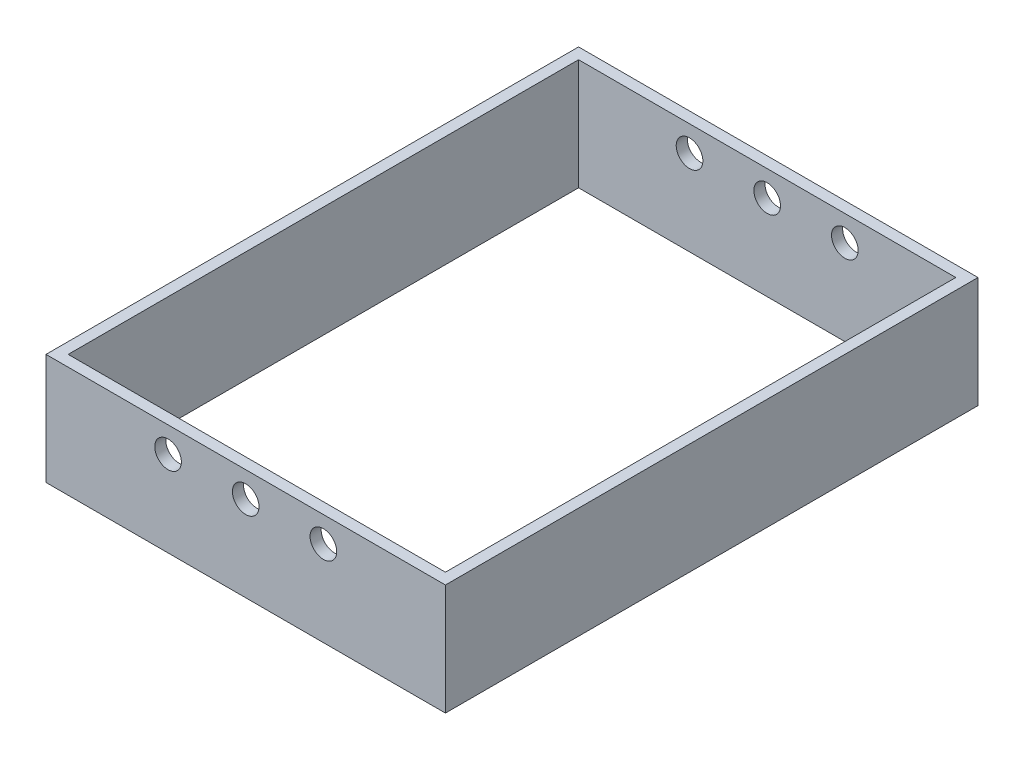
ISO-10303-21;
HEADER;
FILE_DESCRIPTION(('STEP AP214'),'2;1');
FILE_NAME('part.step','',(''),(''),'','','');
FILE_SCHEMA(('AUTOMOTIVE_DESIGN { 1 0 10303 214 1 1 1 1 }'));
ENDSEC;
DATA;
#1=APPLICATION_CONTEXT('core data for automotive mechanical design processes');
#2=APPLICATION_PROTOCOL_DEFINITION('international standard','automotive_design',2000,#1);
#3=PRODUCT_CONTEXT('',#1,'mechanical');
#4=PRODUCT('Part','Part','',(#3));
#5=PRODUCT_RELATED_PRODUCT_CATEGORY('part','',(#4));
#6=PRODUCT_DEFINITION_FORMATION('','',#4);
#7=PRODUCT_DEFINITION_CONTEXT('part definition',#1,'design');
#8=PRODUCT_DEFINITION('design','',#6,#7);
#9=PRODUCT_DEFINITION_SHAPE('','',#8);
#10=(LENGTH_UNIT() NAMED_UNIT(*) SI_UNIT(.MILLI.,.METRE.));
#11=(NAMED_UNIT(*) PLANE_ANGLE_UNIT() SI_UNIT($,.RADIAN.));
#12=(NAMED_UNIT(*) SI_UNIT($,.STERADIAN.) SOLID_ANGLE_UNIT());
#13=UNCERTAINTY_MEASURE_WITH_UNIT(LENGTH_MEASURE(1.E-05),#10,'distance_accuracy_value','');
#14=(GEOMETRIC_REPRESENTATION_CONTEXT(3) GLOBAL_UNCERTAINTY_ASSIGNED_CONTEXT((#13)) GLOBAL_UNIT_ASSIGNED_CONTEXT((#10,
#11,#12)) REPRESENTATION_CONTEXT('',''));
#15=CARTESIAN_POINT('',(0.,0.,0.));
#16=DIRECTION('',(0.,0.,1.));
#17=DIRECTION('',(1.,0.,0.));
#18=AXIS2_PLACEMENT_3D('',#15,#16,#17);
#19=CARTESIAN_POINT('',(0.,50.,0.));
#20=DIRECTION('',(0.,-1.,0.));
#21=DIRECTION('',(0.,0.,-1.));
#22=AXIS2_PLACEMENT_3D('',#19,#20,#21);
#23=PLANE('',#22);
#24=DIRECTION('',(0.,0.,-1.));
#25=VECTOR('',#24,1.);
#26=CARTESIAN_POINT('',(90.,50.,120.));
#27=LINE('',#26,#25);
#28=CARTESIAN_POINT('',(90.,50.,120.));
#29=VERTEX_POINT('',#28);
#30=CARTESIAN_POINT('',(90.,50.,-120.));
#31=VERTEX_POINT('',#30);
#32=EDGE_CURVE('E139',#29,#31,#27,.T.);
#33=ORIENTED_EDGE('',*,*,#32,.T.);
#34=DIRECTION('',(-1.,0.,0.));
#35=VECTOR('',#34,1.);
#36=CARTESIAN_POINT('',(-90.,50.,-120.));
#37=LINE('',#36,#35);
#38=CARTESIAN_POINT('',(-90.,50.,-120.));
#39=VERTEX_POINT('',#38);
#40=EDGE_CURVE('E142',#31,#39,#37,.T.);
#41=ORIENTED_EDGE('',*,*,#40,.T.);
#42=DIRECTION('',(0.,0.,1.));
#43=VECTOR('',#42,1.);
#44=CARTESIAN_POINT('',(-90.,50.,120.));
#45=LINE('',#44,#43);
#46=CARTESIAN_POINT('',(-90.,50.,120.));
#47=VERTEX_POINT('',#46);
#48=EDGE_CURVE('E145',#39,#47,#45,.T.);
#49=ORIENTED_EDGE('',*,*,#48,.T.);
#50=DIRECTION('',(1.,0.,0.));
#51=VECTOR('',#50,1.);
#52=CARTESIAN_POINT('',(-90.,50.,120.));
#53=LINE('',#52,#51);
#54=EDGE_CURVE('E147',#47,#29,#53,.T.);
#55=ORIENTED_EDGE('',*,*,#54,.T.);
#56=EDGE_LOOP('',(#33,#41,#49,#55));
#57=FACE_BOUND('',#56,.T.);
#58=DIRECTION('',(0.,0.,-1.));
#59=VECTOR('',#58,1.);
#60=CARTESIAN_POINT('',(85.,50.,-115.));
#61=LINE('',#60,#59);
#62=CARTESIAN_POINT('',(85.,50.,115.));
#63=VERTEX_POINT('',#62);
#64=CARTESIAN_POINT('',(85.,50.,-115.));
#65=VERTEX_POINT('',#64);
#66=EDGE_CURVE('E101',#63,#65,#61,.T.);
#67=ORIENTED_EDGE('',*,*,#66,.F.);
#68=DIRECTION('',(1.,0.,0.));
#69=VECTOR('',#68,1.);
#70=CARTESIAN_POINT('',(-85.,50.,115.));
#71=LINE('',#70,#69);
#72=CARTESIAN_POINT('',(-85.,50.,115.));
#73=VERTEX_POINT('',#72);
#74=EDGE_CURVE('E123',#73,#63,#71,.T.);
#75=ORIENTED_EDGE('',*,*,#74,.F.);
#76=DIRECTION('',(0.,0.,1.));
#77=VECTOR('',#76,1.);
#78=CARTESIAN_POINT('',(-85.,50.,-115.));
#79=LINE('',#78,#77);
#80=CARTESIAN_POINT('',(-85.,50.,-115.));
#81=VERTEX_POINT('',#80);
#82=EDGE_CURVE('E121',#81,#73,#79,.T.);
#83=ORIENTED_EDGE('',*,*,#82,.F.);
#84=DIRECTION('',(-1.,0.,0.));
#85=VECTOR('',#84,1.);
#86=CARTESIAN_POINT('',(-85.,50.,-115.));
#87=LINE('',#86,#85);
#88=EDGE_CURVE('E109',#65,#81,#87,.T.);
#89=ORIENTED_EDGE('',*,*,#88,.F.);
#90=EDGE_LOOP('',(#67,#75,#83,#89));
#91=FACE_BOUND('',#90,.T.);
#92=ADVANCED_FACE('F34',(#57,#91),#23,.F.);
#93=CARTESIAN_POINT('',(0.,0.,0.));
#94=DIRECTION('',(0.,-1.,0.));
#95=DIRECTION('',(0.,0.,-1.));
#96=AXIS2_PLACEMENT_3D('',#93,#94,#95);
#97=PLANE('',#96);
#98=DIRECTION('',(0.,0.,-1.));
#99=VECTOR('',#98,1.);
#100=CARTESIAN_POINT('',(90.,0.,120.));
#101=LINE('',#100,#99);
#102=CARTESIAN_POINT('',(90.,0.,120.));
#103=VERTEX_POINT('',#102);
#104=CARTESIAN_POINT('',(90.,0.,-120.));
#105=VERTEX_POINT('',#104);
#106=EDGE_CURVE('E117',#103,#105,#101,.T.);
#107=ORIENTED_EDGE('',*,*,#106,.F.);
#108=DIRECTION('',(1.,0.,0.));
#109=VECTOR('',#108,1.);
#110=CARTESIAN_POINT('',(-90.,0.,120.));
#111=LINE('',#110,#109);
#112=CARTESIAN_POINT('',(-90.,0.,120.));
#113=VERTEX_POINT('',#112);
#114=EDGE_CURVE('E143',#113,#103,#111,.T.);
#115=ORIENTED_EDGE('',*,*,#114,.F.);
#116=DIRECTION('',(0.,0.,1.));
#117=VECTOR('',#116,1.);
#118=CARTESIAN_POINT('',(-90.,0.,120.));
#119=LINE('',#118,#117);
#120=CARTESIAN_POINT('',(-90.,0.,-120.));
#121=VERTEX_POINT('',#120);
#122=EDGE_CURVE('E154',#121,#113,#119,.T.);
#123=ORIENTED_EDGE('',*,*,#122,.F.);
#124=DIRECTION('',(-1.,0.,0.));
#125=VECTOR('',#124,1.);
#126=CARTESIAN_POINT('',(-90.,0.,-120.));
#127=LINE('',#126,#125);
#128=EDGE_CURVE('E152',#105,#121,#127,.T.);
#129=ORIENTED_EDGE('',*,*,#128,.F.);
#130=EDGE_LOOP('',(#107,#115,#123,#129));
#131=FACE_BOUND('',#130,.T.);
#132=DIRECTION('',(1.,0.,0.));
#133=VECTOR('',#132,1.);
#134=CARTESIAN_POINT('',(-85.,0.,115.));
#135=LINE('',#134,#133);
#136=CARTESIAN_POINT('',(-85.,0.,115.));
#137=VERTEX_POINT('',#136);
#138=CARTESIAN_POINT('',(85.,0.,115.));
#139=VERTEX_POINT('',#138);
#140=EDGE_CURVE('E110',#137,#139,#135,.T.);
#141=ORIENTED_EDGE('',*,*,#140,.T.);
#142=DIRECTION('',(0.,0.,-1.));
#143=VECTOR('',#142,1.);
#144=CARTESIAN_POINT('',(85.,0.,-115.));
#145=LINE('',#144,#143);
#146=CARTESIAN_POINT('',(85.,0.,-115.));
#147=VERTEX_POINT('',#146);
#148=EDGE_CURVE('E59',#139,#147,#145,.T.);
#149=ORIENTED_EDGE('',*,*,#148,.T.);
#150=DIRECTION('',(-1.,0.,0.));
#151=VECTOR('',#150,1.);
#152=CARTESIAN_POINT('',(-85.,0.,-115.));
#153=LINE('',#152,#151);
#154=CARTESIAN_POINT('',(-85.,0.,-115.));
#155=VERTEX_POINT('',#154);
#156=EDGE_CURVE('E116',#147,#155,#153,.T.);
#157=ORIENTED_EDGE('',*,*,#156,.T.);
#158=DIRECTION('',(0.,0.,1.));
#159=VECTOR('',#158,1.);
#160=CARTESIAN_POINT('',(-85.,0.,-115.));
#161=LINE('',#160,#159);
#162=EDGE_CURVE('E131',#155,#137,#161,.T.);
#163=ORIENTED_EDGE('',*,*,#162,.T.);
#164=EDGE_LOOP('',(#141,#149,#157,#163));
#165=FACE_BOUND('',#164,.T.);
#166=ADVANCED_FACE('F201',(#131,#165),#97,.T.);
#167=CARTESIAN_POINT('',(90.,50.,120.));
#168=DIRECTION('',(-1.,0.,0.));
#169=DIRECTION('',(0.,0.,1.));
#170=AXIS2_PLACEMENT_3D('',#167,#168,#169);
#171=PLANE('',#170);
#172=ORIENTED_EDGE('',*,*,#106,.T.);
#173=DIRECTION('',(0.,-1.,0.));
#174=VECTOR('',#173,1.);
#175=CARTESIAN_POINT('',(90.,50.,-120.));
#176=LINE('',#175,#174);
#177=EDGE_CURVE('E11',#31,#105,#176,.T.);
#178=ORIENTED_EDGE('',*,*,#177,.F.);
#179=ORIENTED_EDGE('',*,*,#32,.F.);
#180=DIRECTION('',(0.,-1.,0.));
#181=VECTOR('',#180,1.);
#182=CARTESIAN_POINT('',(90.,50.,120.));
#183=LINE('',#182,#181);
#184=EDGE_CURVE('E149',#29,#103,#183,.T.);
#185=ORIENTED_EDGE('',*,*,#184,.T.);
#186=EDGE_LOOP('',(#172,#178,#179,#185));
#187=FACE_BOUND('',#186,.T.);
#188=ADVANCED_FACE('F36',(#187),#171,.F.);
#189=CARTESIAN_POINT('',(-90.,50.,-120.));
#190=DIRECTION('',(0.,0.,1.));
#191=DIRECTION('',(1.,0.,0.));
#192=AXIS2_PLACEMENT_3D('',#189,#190,#191);
#193=PLANE('',#192);
#194=CARTESIAN_POINT('',(-35.,38.5,-120.));
#195=DIRECTION('',(0.,0.,1.));
#196=DIRECTION('',(1.,0.,0.));
#197=AXIS2_PLACEMENT_3D('',#194,#195,#196);
#198=CIRCLE('',#197,6.);
#199=CARTESIAN_POINT('',(-29.,38.5,-120.));
#200=VERTEX_POINT('',#199);
#201=EDGE_CURVE('E167',#200,#200,#198,.T.);
#202=ORIENTED_EDGE('',*,*,#201,.T.);
#203=EDGE_LOOP('',(#202));
#204=FACE_BOUND('',#203,.T.);
#205=CARTESIAN_POINT('',(0.,38.5,-120.));
#206=DIRECTION('',(0.,0.,1.));
#207=DIRECTION('',(1.,0.,0.));
#208=AXIS2_PLACEMENT_3D('',#205,#206,#207);
#209=CIRCLE('',#208,6.);
#210=CARTESIAN_POINT('',(6.,38.5,-120.));
#211=VERTEX_POINT('',#210);
#212=EDGE_CURVE('E240',#211,#211,#209,.T.);
#213=ORIENTED_EDGE('',*,*,#212,.T.);
#214=EDGE_LOOP('',(#213));
#215=FACE_BOUND('',#214,.T.);
#216=CARTESIAN_POINT('',(35.,38.5,-120.));
#217=DIRECTION('',(0.,0.,1.));
#218=DIRECTION('',(1.,0.,0.));
#219=AXIS2_PLACEMENT_3D('',#216,#217,#218);
#220=CIRCLE('',#219,6.);
#221=CARTESIAN_POINT('',(41.,38.5,-120.));
#222=VERTEX_POINT('',#221);
#223=EDGE_CURVE('E244',#222,#222,#220,.T.);
#224=ORIENTED_EDGE('',*,*,#223,.T.);
#225=EDGE_LOOP('',(#224));
#226=FACE_BOUND('',#225,.T.);
#227=ORIENTED_EDGE('',*,*,#128,.T.);
#228=DIRECTION('',(0.,-1.,0.));
#229=VECTOR('',#228,1.);
#230=CARTESIAN_POINT('',(-90.,50.,-120.));
#231=LINE('',#230,#229);
#232=EDGE_CURVE('E43',#39,#121,#231,.T.);
#233=ORIENTED_EDGE('',*,*,#232,.F.);
#234=ORIENTED_EDGE('',*,*,#40,.F.);
#235=ORIENTED_EDGE('',*,*,#177,.T.);
#236=EDGE_LOOP('',(#227,#233,#234,#235));
#237=FACE_BOUND('',#236,.T.);
#238=ADVANCED_FACE('F226',(#204,#215,#226,#237),#193,.F.);
#239=CARTESIAN_POINT('',(-90.,50.,120.));
#240=DIRECTION('',(1.,0.,0.));
#241=DIRECTION('',(0.,0.,-1.));
#242=AXIS2_PLACEMENT_3D('',#239,#240,#241);
#243=PLANE('',#242);
#244=ORIENTED_EDGE('',*,*,#122,.T.);
#245=DIRECTION('',(0.,-1.,0.));
#246=VECTOR('',#245,1.);
#247=CARTESIAN_POINT('',(-90.,50.,120.));
#248=LINE('',#247,#246);
#249=EDGE_CURVE('E159',#47,#113,#248,.T.);
#250=ORIENTED_EDGE('',*,*,#249,.F.);
#251=ORIENTED_EDGE('',*,*,#48,.F.);
#252=ORIENTED_EDGE('',*,*,#232,.T.);
#253=EDGE_LOOP('',(#244,#250,#251,#252));
#254=FACE_BOUND('',#253,.T.);
#255=ADVANCED_FACE('F223',(#254),#243,.F.);
#256=CARTESIAN_POINT('',(-90.,50.,120.));
#257=DIRECTION('',(0.,0.,-1.));
#258=DIRECTION('',(-1.,0.,0.));
#259=AXIS2_PLACEMENT_3D('',#256,#257,#258);
#260=PLANE('',#259);
#261=CARTESIAN_POINT('',(-35.,38.5,120.));
#262=DIRECTION('',(0.,0.,1.));
#263=DIRECTION('',(1.,0.,0.));
#264=AXIS2_PLACEMENT_3D('',#261,#262,#263);
#265=CIRCLE('',#264,6.);
#266=CARTESIAN_POINT('',(-29.,38.5,120.));
#267=VERTEX_POINT('',#266);
#268=EDGE_CURVE('E263',#267,#267,#265,.T.);
#269=ORIENTED_EDGE('',*,*,#268,.F.);
#270=EDGE_LOOP('',(#269));
#271=FACE_BOUND('',#270,.T.);
#272=CARTESIAN_POINT('',(0.,38.5,120.));
#273=DIRECTION('',(0.,0.,1.));
#274=DIRECTION('',(1.,0.,0.));
#275=AXIS2_PLACEMENT_3D('',#272,#273,#274);
#276=CIRCLE('',#275,6.);
#277=CARTESIAN_POINT('',(6.,38.5,120.));
#278=VERTEX_POINT('',#277);
#279=EDGE_CURVE('E257',#278,#278,#276,.T.);
#280=ORIENTED_EDGE('',*,*,#279,.F.);
#281=EDGE_LOOP('',(#280));
#282=FACE_BOUND('',#281,.T.);
#283=CARTESIAN_POINT('',(35.,38.5,120.));
#284=DIRECTION('',(0.,0.,1.));
#285=DIRECTION('',(1.,0.,0.));
#286=AXIS2_PLACEMENT_3D('',#283,#284,#285);
#287=CIRCLE('',#286,6.);
#288=CARTESIAN_POINT('',(41.,38.5,120.));
#289=VERTEX_POINT('',#288);
#290=EDGE_CURVE('E180',#289,#289,#287,.T.);
#291=ORIENTED_EDGE('',*,*,#290,.F.);
#292=EDGE_LOOP('',(#291));
#293=FACE_BOUND('',#292,.T.);
#294=ORIENTED_EDGE('',*,*,#114,.T.);
#295=ORIENTED_EDGE('',*,*,#184,.F.);
#296=ORIENTED_EDGE('',*,*,#54,.F.);
#297=ORIENTED_EDGE('',*,*,#249,.T.);
#298=EDGE_LOOP('',(#294,#295,#296,#297));
#299=FACE_BOUND('',#298,.T.);
#300=ADVANCED_FACE('F220',(#271,#282,#293,#299),#260,.F.);
#301=CARTESIAN_POINT('',(85.,50.,-115.));
#302=DIRECTION('',(-1.,0.,0.));
#303=DIRECTION('',(0.,0.,1.));
#304=AXIS2_PLACEMENT_3D('',#301,#302,#303);
#305=PLANE('',#304);
#306=ORIENTED_EDGE('',*,*,#148,.F.);
#307=DIRECTION('',(0.,-1.,0.));
#308=VECTOR('',#307,1.);
#309=CARTESIAN_POINT('',(85.,50.,115.));
#310=LINE('',#309,#308);
#311=EDGE_CURVE('E105',#63,#139,#310,.T.);
#312=ORIENTED_EDGE('',*,*,#311,.F.);
#313=ORIENTED_EDGE('',*,*,#66,.T.);
#314=DIRECTION('',(0.,-1.,0.));
#315=VECTOR('',#314,1.);
#316=CARTESIAN_POINT('',(85.,50.,-115.));
#317=LINE('',#316,#315);
#318=EDGE_CURVE('E104',#65,#147,#317,.T.);
#319=ORIENTED_EDGE('',*,*,#318,.T.);
#320=EDGE_LOOP('',(#306,#312,#313,#319));
#321=FACE_BOUND('',#320,.T.);
#322=ADVANCED_FACE('F103',(#321),#305,.T.);
#323=CARTESIAN_POINT('',(-85.,50.,-115.));
#324=DIRECTION('',(0.,0.,1.));
#325=DIRECTION('',(1.,0.,0.));
#326=AXIS2_PLACEMENT_3D('',#323,#324,#325);
#327=PLANE('',#326);
#328=CARTESIAN_POINT('',(-35.,38.5,-115.));
#329=DIRECTION('',(0.,0.,1.));
#330=DIRECTION('',(1.,0.,0.));
#331=AXIS2_PLACEMENT_3D('',#328,#329,#330);
#332=CIRCLE('',#331,6.);
#333=CARTESIAN_POINT('',(-29.,38.5,-115.));
#334=VERTEX_POINT('',#333);
#335=EDGE_CURVE('E129',#334,#334,#332,.T.);
#336=ORIENTED_EDGE('',*,*,#335,.F.);
#337=EDGE_LOOP('',(#336));
#338=FACE_BOUND('',#337,.T.);
#339=CARTESIAN_POINT('',(0.,38.5,-115.));
#340=DIRECTION('',(0.,0.,1.));
#341=DIRECTION('',(1.,0.,0.));
#342=AXIS2_PLACEMENT_3D('',#339,#340,#341);
#343=CIRCLE('',#342,6.);
#344=CARTESIAN_POINT('',(6.,38.5,-115.));
#345=VERTEX_POINT('',#344);
#346=EDGE_CURVE('E170',#345,#345,#343,.T.);
#347=ORIENTED_EDGE('',*,*,#346,.F.);
#348=EDGE_LOOP('',(#347));
#349=FACE_BOUND('',#348,.T.);
#350=CARTESIAN_POINT('',(35.,38.5,-115.));
#351=DIRECTION('',(0.,0.,1.));
#352=DIRECTION('',(1.,0.,0.));
#353=AXIS2_PLACEMENT_3D('',#350,#351,#352);
#354=CIRCLE('',#353,6.);
#355=CARTESIAN_POINT('',(41.,38.5,-115.));
#356=VERTEX_POINT('',#355);
#357=EDGE_CURVE('E166',#356,#356,#354,.T.);
#358=ORIENTED_EDGE('',*,*,#357,.F.);
#359=EDGE_LOOP('',(#358));
#360=FACE_BOUND('',#359,.T.);
#361=ORIENTED_EDGE('',*,*,#156,.F.);
#362=ORIENTED_EDGE('',*,*,#318,.F.);
#363=ORIENTED_EDGE('',*,*,#88,.T.);
#364=DIRECTION('',(0.,-1.,0.));
#365=VECTOR('',#364,1.);
#366=CARTESIAN_POINT('',(-85.,50.,-115.));
#367=LINE('',#366,#365);
#368=EDGE_CURVE('E118',#81,#155,#367,.T.);
#369=ORIENTED_EDGE('',*,*,#368,.T.);
#370=EDGE_LOOP('',(#361,#362,#363,#369));
#371=FACE_BOUND('',#370,.T.);
#372=ADVANCED_FACE('F113',(#338,#349,#360,#371),#327,.T.);
#373=CARTESIAN_POINT('',(-85.,50.,-115.));
#374=DIRECTION('',(1.,0.,0.));
#375=DIRECTION('',(0.,0.,-1.));
#376=AXIS2_PLACEMENT_3D('',#373,#374,#375);
#377=PLANE('',#376);
#378=ORIENTED_EDGE('',*,*,#162,.F.);
#379=ORIENTED_EDGE('',*,*,#368,.F.);
#380=ORIENTED_EDGE('',*,*,#82,.T.);
#381=DIRECTION('',(0.,-1.,0.));
#382=VECTOR('',#381,1.);
#383=CARTESIAN_POINT('',(-85.,50.,115.));
#384=LINE('',#383,#382);
#385=EDGE_CURVE('E51',#73,#137,#384,.T.);
#386=ORIENTED_EDGE('',*,*,#385,.T.);
#387=EDGE_LOOP('',(#378,#379,#380,#386));
#388=FACE_BOUND('',#387,.T.);
#389=ADVANCED_FACE('F195',(#388),#377,.T.);
#390=CARTESIAN_POINT('',(-85.,50.,115.));
#391=DIRECTION('',(0.,0.,-1.));
#392=DIRECTION('',(-1.,0.,0.));
#393=AXIS2_PLACEMENT_3D('',#390,#391,#392);
#394=PLANE('',#393);
#395=CARTESIAN_POINT('',(-35.,38.5,115.));
#396=DIRECTION('',(0.,0.,-1.));
#397=DIRECTION('',(-1.,0.,0.));
#398=AXIS2_PLACEMENT_3D('',#395,#396,#397);
#399=CIRCLE('',#398,6.);
#400=CARTESIAN_POINT('',(-41.,38.5,115.));
#401=VERTEX_POINT('',#400);
#402=EDGE_CURVE('E38',#401,#401,#399,.T.);
#403=ORIENTED_EDGE('',*,*,#402,.F.);
#404=EDGE_LOOP('',(#403));
#405=FACE_BOUND('',#404,.T.);
#406=CARTESIAN_POINT('',(0.,38.5,115.));
#407=DIRECTION('',(0.,0.,-1.));
#408=DIRECTION('',(-1.,0.,0.));
#409=AXIS2_PLACEMENT_3D('',#406,#407,#408);
#410=CIRCLE('',#409,6.);
#411=CARTESIAN_POINT('',(-6.,38.5,115.));
#412=VERTEX_POINT('',#411);
#413=EDGE_CURVE('E168',#412,#412,#410,.T.);
#414=ORIENTED_EDGE('',*,*,#413,.F.);
#415=EDGE_LOOP('',(#414));
#416=FACE_BOUND('',#415,.T.);
#417=CARTESIAN_POINT('',(35.,38.5,115.));
#418=DIRECTION('',(0.,0.,-1.));
#419=DIRECTION('',(-1.,0.,0.));
#420=AXIS2_PLACEMENT_3D('',#417,#418,#419);
#421=CIRCLE('',#420,6.);
#422=CARTESIAN_POINT('',(29.,38.5,115.));
#423=VERTEX_POINT('',#422);
#424=EDGE_CURVE('E164',#423,#423,#421,.T.);
#425=ORIENTED_EDGE('',*,*,#424,.F.);
#426=EDGE_LOOP('',(#425));
#427=FACE_BOUND('',#426,.T.);
#428=ORIENTED_EDGE('',*,*,#140,.F.);
#429=ORIENTED_EDGE('',*,*,#385,.F.);
#430=ORIENTED_EDGE('',*,*,#74,.T.);
#431=ORIENTED_EDGE('',*,*,#311,.T.);
#432=EDGE_LOOP('',(#428,#429,#430,#431));
#433=FACE_BOUND('',#432,.T.);
#434=ADVANCED_FACE('F191',(#405,#416,#427,#433),#394,.T.);
#435=CARTESIAN_POINT('',(35.,38.5,-120.));
#436=DIRECTION('',(0.,0.,1.));
#437=DIRECTION('',(1.,0.,0.));
#438=AXIS2_PLACEMENT_3D('',#435,#436,#437);
#439=CYLINDRICAL_SURFACE('',#438,6.);
#440=ORIENTED_EDGE('',*,*,#424,.T.);
#441=EDGE_LOOP('',(#440));
#442=FACE_BOUND('',#441,.T.);
#443=ORIENTED_EDGE('',*,*,#290,.T.);
#444=EDGE_LOOP('',(#443));
#445=FACE_BOUND('',#444,.T.);
#446=ADVANCED_FACE('F194',(#442,#445),#439,.F.);
#447=CARTESIAN_POINT('',(0.,38.5,-120.));
#448=DIRECTION('',(0.,0.,1.));
#449=DIRECTION('',(1.,0.,0.));
#450=AXIS2_PLACEMENT_3D('',#447,#448,#449);
#451=CYLINDRICAL_SURFACE('',#450,6.);
#452=ORIENTED_EDGE('',*,*,#413,.T.);
#453=EDGE_LOOP('',(#452));
#454=FACE_BOUND('',#453,.T.);
#455=ORIENTED_EDGE('',*,*,#279,.T.);
#456=EDGE_LOOP('',(#455));
#457=FACE_BOUND('',#456,.T.);
#458=ADVANCED_FACE('F273',(#454,#457),#451,.F.);
#459=CARTESIAN_POINT('',(-35.,38.5,-120.));
#460=DIRECTION('',(0.,0.,1.));
#461=DIRECTION('',(1.,0.,0.));
#462=AXIS2_PLACEMENT_3D('',#459,#460,#461);
#463=CYLINDRICAL_SURFACE('',#462,6.);
#464=ORIENTED_EDGE('',*,*,#402,.T.);
#465=EDGE_LOOP('',(#464));
#466=FACE_BOUND('',#465,.T.);
#467=ORIENTED_EDGE('',*,*,#268,.T.);
#468=EDGE_LOOP('',(#467));
#469=FACE_BOUND('',#468,.T.);
#470=ADVANCED_FACE('F188',(#466,#469),#463,.F.);
#471=ORIENTED_EDGE('',*,*,#357,.T.);
#472=EDGE_LOOP('',(#471));
#473=FACE_BOUND('',#472,.T.);
#474=ORIENTED_EDGE('',*,*,#223,.F.);
#475=EDGE_LOOP('',(#474));
#476=FACE_BOUND('',#475,.T.);
#477=ADVANCED_FACE('F276',(#473,#476),#439,.F.);
#478=ORIENTED_EDGE('',*,*,#346,.T.);
#479=EDGE_LOOP('',(#478));
#480=FACE_BOUND('',#479,.T.);
#481=ORIENTED_EDGE('',*,*,#212,.F.);
#482=EDGE_LOOP('',(#481));
#483=FACE_BOUND('',#482,.T.);
#484=ADVANCED_FACE('F281',(#480,#483),#451,.F.);
#485=ORIENTED_EDGE('',*,*,#335,.T.);
#486=EDGE_LOOP('',(#485));
#487=FACE_BOUND('',#486,.T.);
#488=ORIENTED_EDGE('',*,*,#201,.F.);
#489=EDGE_LOOP('',(#488));
#490=FACE_BOUND('',#489,.T.);
#491=ADVANCED_FACE('F287',(#487,#490),#463,.F.);
#492=CLOSED_SHELL('',(#92,#166,#188,#238,#255,#300,#322,#372,#389,#434,#446,#458,#470,#477,#484,#491));
#493=MANIFOLD_SOLID_BREP('B2',#492);
#494=ADVANCED_BREP_SHAPE_REPRESENTATION('',(#18,#493),#14);
#495=SHAPE_DEFINITION_REPRESENTATION(#9,#494);
ENDSEC;
END-ISO-10303-21;
